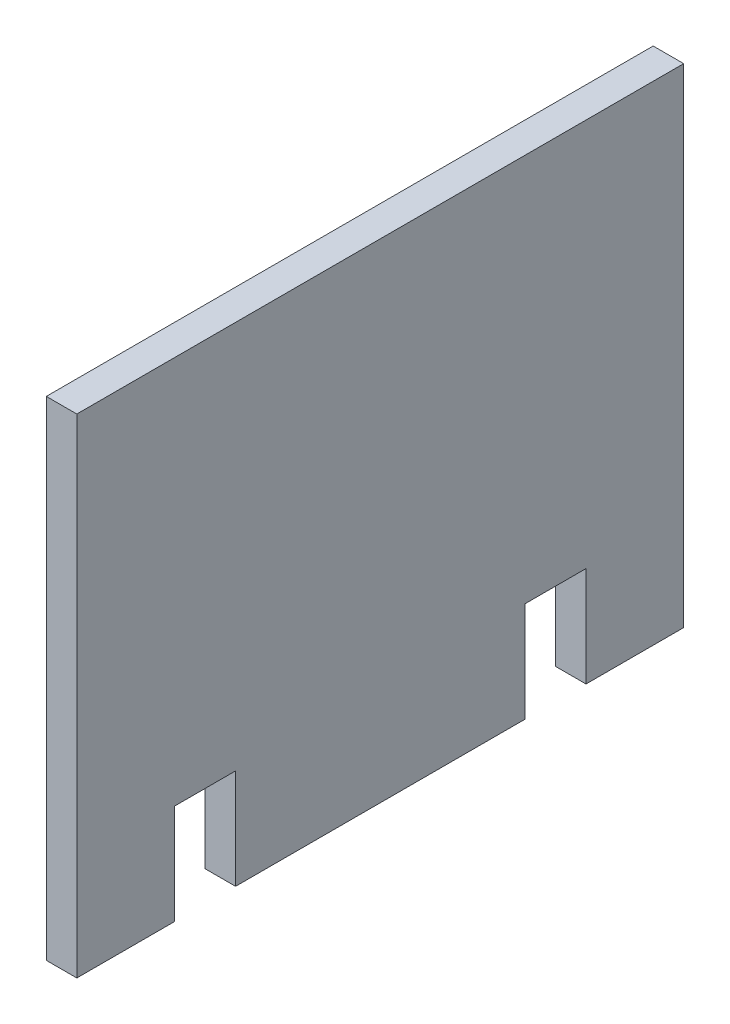
ISO-10303-21;
HEADER;
FILE_DESCRIPTION(('STEP AP214'),'2;1');
FILE_NAME('part.step','',(''),(''),'','','');
FILE_SCHEMA(('AUTOMOTIVE_DESIGN { 1 0 10303 214 1 1 1 1 }'));
ENDSEC;
DATA;
#1=APPLICATION_CONTEXT('core data for automotive mechanical design processes');
#2=APPLICATION_PROTOCOL_DEFINITION('international standard','automotive_design',2000,#1);
#3=PRODUCT_CONTEXT('',#1,'mechanical');
#4=PRODUCT('Part','Part','',(#3));
#5=PRODUCT_RELATED_PRODUCT_CATEGORY('part','',(#4));
#6=PRODUCT_DEFINITION_FORMATION('','',#4);
#7=PRODUCT_DEFINITION_CONTEXT('part definition',#1,'design');
#8=PRODUCT_DEFINITION('design','',#6,#7);
#9=PRODUCT_DEFINITION_SHAPE('','',#8);
#10=(LENGTH_UNIT() NAMED_UNIT(*) SI_UNIT(.MILLI.,.METRE.));
#11=(NAMED_UNIT(*) PLANE_ANGLE_UNIT() SI_UNIT($,.RADIAN.));
#12=(NAMED_UNIT(*) SI_UNIT($,.STERADIAN.) SOLID_ANGLE_UNIT());
#13=UNCERTAINTY_MEASURE_WITH_UNIT(LENGTH_MEASURE(1.E-05),#10,'distance_accuracy_value','');
#14=(GEOMETRIC_REPRESENTATION_CONTEXT(3) GLOBAL_UNCERTAINTY_ASSIGNED_CONTEXT((#13)) GLOBAL_UNIT_ASSIGNED_CONTEXT((#10,
#11,#12)) REPRESENTATION_CONTEXT('',''));
#15=CARTESIAN_POINT('',(0.,0.,0.));
#16=DIRECTION('',(0.,0.,1.));
#17=DIRECTION('',(1.,0.,0.));
#18=AXIS2_PLACEMENT_3D('',#15,#16,#17);
#19=CARTESIAN_POINT('',(3.175,0.,0.));
#20=DIRECTION('',(0.,1.,0.));
#21=DIRECTION('',(0.,0.,1.));
#22=AXIS2_PLACEMENT_3D('',#19,#20,#21);
#23=PLANE('',#22);
#24=DIRECTION('',(0.,0.,-1.));
#25=VECTOR('',#24,1.);
#26=CARTESIAN_POINT('',(0.,0.,0.));
#27=LINE('',#26,#25);
#28=CARTESIAN_POINT('',(0.,0.,0.));
#29=VERTEX_POINT('',#28);
#30=CARTESIAN_POINT('',(0.,0.,-10.16));
#31=VERTEX_POINT('',#30);
#32=EDGE_CURVE('E144',#29,#31,#27,.T.);
#33=ORIENTED_EDGE('',*,*,#32,.T.);
#34=DIRECTION('',(1.,0.,0.));
#35=VECTOR('',#34,1.);
#36=CARTESIAN_POINT('',(0.,0.,-10.16));
#37=LINE('',#36,#35);
#38=CARTESIAN_POINT('',(3.175,0.,-10.16));
#39=VERTEX_POINT('',#38);
#40=EDGE_CURVE('E130',#31,#39,#37,.T.);
#41=ORIENTED_EDGE('',*,*,#40,.T.);
#42=DIRECTION('',(0.,0.,-1.));
#43=VECTOR('',#42,1.);
#44=CARTESIAN_POINT('',(3.175,0.,0.));
#45=LINE('',#44,#43);
#46=CARTESIAN_POINT('',(3.175,0.,0.));
#47=VERTEX_POINT('',#46);
#48=EDGE_CURVE('E176',#47,#39,#45,.T.);
#49=ORIENTED_EDGE('',*,*,#48,.F.);
#50=DIRECTION('',(-1.,0.,0.));
#51=VECTOR('',#50,1.);
#52=CARTESIAN_POINT('',(3.175,0.,0.));
#53=LINE('',#52,#51);
#54=EDGE_CURVE('E11',#47,#29,#53,.T.);
#55=ORIENTED_EDGE('',*,*,#54,.T.);
#56=EDGE_LOOP('',(#33,#41,#49,#55));
#57=FACE_BOUND('',#56,.T.);
#58=ADVANCED_FACE('F41',(#57),#23,.F.);
#59=CARTESIAN_POINT('',(3.175,0.,-52.96));
#60=VERTEX_POINT('',#59);
#61=CARTESIAN_POINT('',(3.175,0.,-63.12));
#62=VERTEX_POINT('',#61);
#63=EDGE_CURVE('E179',#60,#62,#45,.T.);
#64=ORIENTED_EDGE('',*,*,#63,.F.);
#65=DIRECTION('',(1.,0.,0.));
#66=VECTOR('',#65,1.);
#67=CARTESIAN_POINT('',(0.,0.,-52.96));
#68=LINE('',#67,#66);
#69=CARTESIAN_POINT('',(0.,0.,-52.96));
#70=VERTEX_POINT('',#69);
#71=EDGE_CURVE('E199',#70,#60,#68,.T.);
#72=ORIENTED_EDGE('',*,*,#71,.F.);
#73=CARTESIAN_POINT('',(0.,0.,-63.12));
#74=VERTEX_POINT('',#73);
#75=EDGE_CURVE('E154',#70,#74,#27,.T.);
#76=ORIENTED_EDGE('',*,*,#75,.T.);
#77=DIRECTION('',(-1.,0.,0.));
#78=VECTOR('',#77,1.);
#79=CARTESIAN_POINT('',(3.175,0.,-63.12));
#80=LINE('',#79,#78);
#81=EDGE_CURVE('E49',#62,#74,#80,.T.);
#82=ORIENTED_EDGE('',*,*,#81,.F.);
#83=EDGE_LOOP('',(#64,#72,#76,#82));
#84=FACE_BOUND('',#83,.T.);
#85=ADVANCED_FACE('F233',(#84),#23,.F.);
#86=CARTESIAN_POINT('',(3.175,0.,0.));
#87=DIRECTION('',(0.,0.,-1.));
#88=DIRECTION('',(-1.,0.,0.));
#89=AXIS2_PLACEMENT_3D('',#86,#87,#88);
#90=PLANE('',#89);
#91=DIRECTION('',(0.,-1.,0.));
#92=VECTOR('',#91,1.);
#93=CARTESIAN_POINT('',(0.,0.,0.));
#94=LINE('',#93,#92);
#95=CARTESIAN_POINT('',(0.,50.8,0.));
#96=VERTEX_POINT('',#95);
#97=EDGE_CURVE('E159',#96,#29,#94,.T.);
#98=ORIENTED_EDGE('',*,*,#97,.T.);
#99=ORIENTED_EDGE('',*,*,#54,.F.);
#100=DIRECTION('',(0.,-1.,0.));
#101=VECTOR('',#100,1.);
#102=CARTESIAN_POINT('',(3.175,0.,0.));
#103=LINE('',#102,#101);
#104=CARTESIAN_POINT('',(3.175,50.8,0.));
#105=VERTEX_POINT('',#104);
#106=EDGE_CURVE('E180',#105,#47,#103,.T.);
#107=ORIENTED_EDGE('',*,*,#106,.F.);
#108=DIRECTION('',(-1.,0.,0.));
#109=VECTOR('',#108,1.);
#110=CARTESIAN_POINT('',(3.175,50.8,0.));
#111=LINE('',#110,#109);
#112=EDGE_CURVE('E173',#105,#96,#111,.T.);
#113=ORIENTED_EDGE('',*,*,#112,.T.);
#114=EDGE_LOOP('',(#98,#99,#107,#113));
#115=FACE_BOUND('',#114,.T.);
#116=ADVANCED_FACE('F43',(#115),#90,.F.);
#117=CARTESIAN_POINT('',(3.175,0.,-16.51));
#118=VERTEX_POINT('',#117);
#119=CARTESIAN_POINT('',(3.175,0.,-46.61));
#120=VERTEX_POINT('',#119);
#121=EDGE_CURVE('E178',#118,#120,#45,.T.);
#122=ORIENTED_EDGE('',*,*,#121,.F.);
#123=DIRECTION('',(1.,0.,0.));
#124=VECTOR('',#123,1.);
#125=CARTESIAN_POINT('',(0.,0.,-16.51));
#126=LINE('',#125,#124);
#127=CARTESIAN_POINT('',(0.,0.,-16.51));
#128=VERTEX_POINT('',#127);
#129=EDGE_CURVE('E139',#128,#118,#126,.T.);
#130=ORIENTED_EDGE('',*,*,#129,.F.);
#131=CARTESIAN_POINT('',(0.,0.,-46.61));
#132=VERTEX_POINT('',#131);
#133=EDGE_CURVE('E152',#128,#132,#27,.T.);
#134=ORIENTED_EDGE('',*,*,#133,.T.);
#135=DIRECTION('',(1.,0.,0.));
#136=VECTOR('',#135,1.);
#137=CARTESIAN_POINT('',(0.,0.,-46.61));
#138=LINE('',#137,#136);
#139=EDGE_CURVE('E201',#132,#120,#138,.T.);
#140=ORIENTED_EDGE('',*,*,#139,.T.);
#141=EDGE_LOOP('',(#122,#130,#134,#140));
#142=FACE_BOUND('',#141,.T.);
#143=ADVANCED_FACE('F223',(#142),#23,.F.);
#144=CARTESIAN_POINT('',(3.175,0.,-63.12));
#145=DIRECTION('',(0.,0.,1.));
#146=DIRECTION('',(1.,0.,0.));
#147=AXIS2_PLACEMENT_3D('',#144,#145,#146);
#148=PLANE('',#147);
#149=DIRECTION('',(0.,1.,0.));
#150=VECTOR('',#149,1.);
#151=CARTESIAN_POINT('',(0.,0.,-63.12));
#152=LINE('',#151,#150);
#153=CARTESIAN_POINT('',(0.,50.8,-63.12));
#154=VERTEX_POINT('',#153);
#155=EDGE_CURVE('E151',#74,#154,#152,.T.);
#156=ORIENTED_EDGE('',*,*,#155,.T.);
#157=DIRECTION('',(-1.,0.,0.));
#158=VECTOR('',#157,1.);
#159=CARTESIAN_POINT('',(3.175,50.8,-63.12));
#160=LINE('',#159,#158);
#161=CARTESIAN_POINT('',(3.175,50.8,-63.12));
#162=VERTEX_POINT('',#161);
#163=EDGE_CURVE('E236',#162,#154,#160,.T.);
#164=ORIENTED_EDGE('',*,*,#163,.F.);
#165=DIRECTION('',(0.,1.,0.));
#166=VECTOR('',#165,1.);
#167=CARTESIAN_POINT('',(3.175,0.,-63.12));
#168=LINE('',#167,#166);
#169=EDGE_CURVE('E174',#62,#162,#168,.T.);
#170=ORIENTED_EDGE('',*,*,#169,.F.);
#171=ORIENTED_EDGE('',*,*,#81,.T.);
#172=EDGE_LOOP('',(#156,#164,#170,#171));
#173=FACE_BOUND('',#172,.T.);
#174=ADVANCED_FACE('F237',(#173),#148,.F.);
#175=CARTESIAN_POINT('',(3.175,50.8,0.));
#176=DIRECTION('',(0.,-1.,0.));
#177=DIRECTION('',(0.,0.,-1.));
#178=AXIS2_PLACEMENT_3D('',#175,#176,#177);
#179=PLANE('',#178);
#180=DIRECTION('',(0.,0.,1.));
#181=VECTOR('',#180,1.);
#182=CARTESIAN_POINT('',(0.,50.8,0.));
#183=LINE('',#182,#181);
#184=EDGE_CURVE('E155',#154,#96,#183,.T.);
#185=ORIENTED_EDGE('',*,*,#184,.T.);
#186=ORIENTED_EDGE('',*,*,#112,.F.);
#187=DIRECTION('',(0.,0.,1.));
#188=VECTOR('',#187,1.);
#189=CARTESIAN_POINT('',(3.175,50.8,0.));
#190=LINE('',#189,#188);
#191=EDGE_CURVE('E171',#162,#105,#190,.T.);
#192=ORIENTED_EDGE('',*,*,#191,.F.);
#193=ORIENTED_EDGE('',*,*,#163,.T.);
#194=EDGE_LOOP('',(#185,#186,#192,#193));
#195=FACE_BOUND('',#194,.T.);
#196=ADVANCED_FACE('F244',(#195),#179,.F.);
#197=CARTESIAN_POINT('',(3.175,0.,0.));
#198=DIRECTION('',(-1.,0.,0.));
#199=DIRECTION('',(0.,0.,1.));
#200=AXIS2_PLACEMENT_3D('',#197,#198,#199);
#201=PLANE('',#200);
#202=ORIENTED_EDGE('',*,*,#48,.T.);
#203=DIRECTION('',(0.,-1.,0.));
#204=VECTOR('',#203,1.);
#205=CARTESIAN_POINT('',(3.175,0.,-10.16));
#206=LINE('',#205,#204);
#207=CARTESIAN_POINT('',(3.175,10.4,-10.16));
#208=VERTEX_POINT('',#207);
#209=EDGE_CURVE('E135',#208,#39,#206,.T.);
#210=ORIENTED_EDGE('',*,*,#209,.F.);
#211=DIRECTION('',(0.,0.,1.));
#212=VECTOR('',#211,1.);
#213=CARTESIAN_POINT('',(3.175,10.4,-10.16));
#214=LINE('',#213,#212);
#215=CARTESIAN_POINT('',(3.175,10.4,-16.51));
#216=VERTEX_POINT('',#215);
#217=EDGE_CURVE('E147',#216,#208,#214,.T.);
#218=ORIENTED_EDGE('',*,*,#217,.F.);
#219=DIRECTION('',(0.,1.,0.));
#220=VECTOR('',#219,1.);
#221=CARTESIAN_POINT('',(3.175,0.,-16.51));
#222=LINE('',#221,#220);
#223=EDGE_CURVE('E211',#118,#216,#222,.T.);
#224=ORIENTED_EDGE('',*,*,#223,.F.);
#225=ORIENTED_EDGE('',*,*,#121,.T.);
#226=DIRECTION('',(0.,-1.,0.));
#227=VECTOR('',#226,1.);
#228=CARTESIAN_POINT('',(3.175,0.,-46.61));
#229=LINE('',#228,#227);
#230=CARTESIAN_POINT('',(3.175,10.4,-46.61));
#231=VERTEX_POINT('',#230);
#232=EDGE_CURVE('E186',#231,#120,#229,.T.);
#233=ORIENTED_EDGE('',*,*,#232,.F.);
#234=DIRECTION('',(0.,0.,1.));
#235=VECTOR('',#234,1.);
#236=CARTESIAN_POINT('',(3.175,10.4,-52.96));
#237=LINE('',#236,#235);
#238=CARTESIAN_POINT('',(3.175,10.4,-52.96));
#239=VERTEX_POINT('',#238);
#240=EDGE_CURVE('E195',#239,#231,#237,.T.);
#241=ORIENTED_EDGE('',*,*,#240,.F.);
#242=DIRECTION('',(0.,1.,0.));
#243=VECTOR('',#242,1.);
#244=CARTESIAN_POINT('',(3.175,0.,-52.96));
#245=LINE('',#244,#243);
#246=EDGE_CURVE('E192',#60,#239,#245,.T.);
#247=ORIENTED_EDGE('',*,*,#246,.F.);
#248=ORIENTED_EDGE('',*,*,#63,.T.);
#249=ORIENTED_EDGE('',*,*,#169,.T.);
#250=ORIENTED_EDGE('',*,*,#191,.T.);
#251=ORIENTED_EDGE('',*,*,#106,.T.);
#252=EDGE_LOOP('',(#202,#210,#218,#224,#225,#233,#241,#247,#248,#249,#250,#251));
#253=FACE_BOUND('',#252,.T.);
#254=ADVANCED_FACE('F229',(#253),#201,.F.);
#255=CARTESIAN_POINT('',(0.,0.,0.));
#256=DIRECTION('',(-1.,0.,0.));
#257=DIRECTION('',(0.,0.,1.));
#258=AXIS2_PLACEMENT_3D('',#255,#256,#257);
#259=PLANE('',#258);
#260=DIRECTION('',(0.,-1.,0.));
#261=VECTOR('',#260,1.);
#262=CARTESIAN_POINT('',(0.,0.,-10.16));
#263=LINE('',#262,#261);
#264=CARTESIAN_POINT('',(0.,10.4,-10.16));
#265=VERTEX_POINT('',#264);
#266=EDGE_CURVE('E133',#265,#31,#263,.T.);
#267=ORIENTED_EDGE('',*,*,#266,.T.);
#268=ORIENTED_EDGE('',*,*,#32,.F.);
#269=ORIENTED_EDGE('',*,*,#97,.F.);
#270=ORIENTED_EDGE('',*,*,#184,.F.);
#271=ORIENTED_EDGE('',*,*,#155,.F.);
#272=ORIENTED_EDGE('',*,*,#75,.F.);
#273=DIRECTION('',(0.,1.,0.));
#274=VECTOR('',#273,1.);
#275=CARTESIAN_POINT('',(0.,0.,-52.96));
#276=LINE('',#275,#274);
#277=CARTESIAN_POINT('',(0.,10.4,-52.96));
#278=VERTEX_POINT('',#277);
#279=EDGE_CURVE('E183',#70,#278,#276,.T.);
#280=ORIENTED_EDGE('',*,*,#279,.T.);
#281=DIRECTION('',(0.,0.,1.));
#282=VECTOR('',#281,1.);
#283=CARTESIAN_POINT('',(0.,10.4,-52.96));
#284=LINE('',#283,#282);
#285=CARTESIAN_POINT('',(0.,10.4,-46.61));
#286=VERTEX_POINT('',#285);
#287=EDGE_CURVE('E187',#278,#286,#284,.T.);
#288=ORIENTED_EDGE('',*,*,#287,.T.);
#289=DIRECTION('',(0.,-1.,0.));
#290=VECTOR('',#289,1.);
#291=CARTESIAN_POINT('',(0.,0.,-46.61));
#292=LINE('',#291,#290);
#293=EDGE_CURVE('E64',#286,#132,#292,.T.);
#294=ORIENTED_EDGE('',*,*,#293,.T.);
#295=ORIENTED_EDGE('',*,*,#133,.F.);
#296=DIRECTION('',(0.,1.,0.));
#297=VECTOR('',#296,1.);
#298=CARTESIAN_POINT('',(0.,0.,-16.51));
#299=LINE('',#298,#297);
#300=CARTESIAN_POINT('',(0.,10.4,-16.51));
#301=VERTEX_POINT('',#300);
#302=EDGE_CURVE('E146',#128,#301,#299,.T.);
#303=ORIENTED_EDGE('',*,*,#302,.T.);
#304=DIRECTION('',(0.,0.,1.));
#305=VECTOR('',#304,1.);
#306=CARTESIAN_POINT('',(0.,10.4,-10.16));
#307=LINE('',#306,#305);
#308=EDGE_CURVE('E56',#301,#265,#307,.T.);
#309=ORIENTED_EDGE('',*,*,#308,.T.);
#310=EDGE_LOOP('',(#267,#268,#269,#270,#271,#272,#280,#288,#294,#295,#303,#309));
#311=FACE_BOUND('',#310,.T.);
#312=ADVANCED_FACE('F142',(#311),#259,.T.);
#313=CARTESIAN_POINT('',(0.,0.,-52.96));
#314=DIRECTION('',(0.,0.,-1.));
#315=DIRECTION('',(0.,1.,0.));
#316=AXIS2_PLACEMENT_3D('',#313,#314,#315);
#317=PLANE('',#316);
#318=ORIENTED_EDGE('',*,*,#246,.T.);
#319=DIRECTION('',(1.,0.,0.));
#320=VECTOR('',#319,1.);
#321=CARTESIAN_POINT('',(0.,10.4,-52.96));
#322=LINE('',#321,#320);
#323=EDGE_CURVE('E191',#278,#239,#322,.T.);
#324=ORIENTED_EDGE('',*,*,#323,.F.);
#325=ORIENTED_EDGE('',*,*,#279,.F.);
#326=ORIENTED_EDGE('',*,*,#71,.T.);
#327=EDGE_LOOP('',(#318,#324,#325,#326));
#328=FACE_BOUND('',#327,.T.);
#329=ADVANCED_FACE('F261',(#328),#317,.F.);
#330=CARTESIAN_POINT('',(0.,0.,-46.61));
#331=DIRECTION('',(0.,0.,1.));
#332=DIRECTION('',(0.,-1.,0.));
#333=AXIS2_PLACEMENT_3D('',#330,#331,#332);
#334=PLANE('',#333);
#335=ORIENTED_EDGE('',*,*,#232,.T.);
#336=ORIENTED_EDGE('',*,*,#139,.F.);
#337=ORIENTED_EDGE('',*,*,#293,.F.);
#338=DIRECTION('',(1.,0.,0.));
#339=VECTOR('',#338,1.);
#340=CARTESIAN_POINT('',(0.,10.4,-46.61));
#341=LINE('',#340,#339);
#342=EDGE_CURVE('E204',#286,#231,#341,.T.);
#343=ORIENTED_EDGE('',*,*,#342,.T.);
#344=EDGE_LOOP('',(#335,#336,#337,#343));
#345=FACE_BOUND('',#344,.T.);
#346=ADVANCED_FACE('F264',(#345),#334,.F.);
#347=CARTESIAN_POINT('',(0.,10.4,-52.96));
#348=DIRECTION('',(0.,1.,0.));
#349=DIRECTION('',(0.,0.,1.));
#350=AXIS2_PLACEMENT_3D('',#347,#348,#349);
#351=PLANE('',#350);
#352=ORIENTED_EDGE('',*,*,#240,.T.);
#353=ORIENTED_EDGE('',*,*,#342,.F.);
#354=ORIENTED_EDGE('',*,*,#287,.F.);
#355=ORIENTED_EDGE('',*,*,#323,.T.);
#356=EDGE_LOOP('',(#352,#353,#354,#355));
#357=FACE_BOUND('',#356,.T.);
#358=ADVANCED_FACE('F267',(#357),#351,.F.);
#359=CARTESIAN_POINT('',(0.,0.,-10.16));
#360=DIRECTION('',(0.,0.,1.));
#361=DIRECTION('',(1.,0.,0.));
#362=AXIS2_PLACEMENT_3D('',#359,#360,#361);
#363=PLANE('',#362);
#364=ORIENTED_EDGE('',*,*,#209,.T.);
#365=ORIENTED_EDGE('',*,*,#40,.F.);
#366=ORIENTED_EDGE('',*,*,#266,.F.);
#367=DIRECTION('',(1.,0.,0.));
#368=VECTOR('',#367,1.);
#369=CARTESIAN_POINT('',(0.,10.4,-10.16));
#370=LINE('',#369,#368);
#371=EDGE_CURVE('E165',#265,#208,#370,.T.);
#372=ORIENTED_EDGE('',*,*,#371,.T.);
#373=EDGE_LOOP('',(#364,#365,#366,#372));
#374=FACE_BOUND('',#373,.T.);
#375=ADVANCED_FACE('F132',(#374),#363,.F.);
#376=CARTESIAN_POINT('',(0.,10.4,-10.16));
#377=DIRECTION('',(0.,1.,0.));
#378=DIRECTION('',(0.,0.,1.));
#379=AXIS2_PLACEMENT_3D('',#376,#377,#378);
#380=PLANE('',#379);
#381=ORIENTED_EDGE('',*,*,#217,.T.);
#382=ORIENTED_EDGE('',*,*,#371,.F.);
#383=ORIENTED_EDGE('',*,*,#308,.F.);
#384=DIRECTION('',(1.,0.,0.));
#385=VECTOR('',#384,1.);
#386=CARTESIAN_POINT('',(0.,10.4,-16.51));
#387=LINE('',#386,#385);
#388=EDGE_CURVE('E168',#301,#216,#387,.T.);
#389=ORIENTED_EDGE('',*,*,#388,.T.);
#390=EDGE_LOOP('',(#381,#382,#383,#389));
#391=FACE_BOUND('',#390,.T.);
#392=ADVANCED_FACE('F276',(#391),#380,.F.);
#393=CARTESIAN_POINT('',(0.,0.,-16.51));
#394=DIRECTION('',(0.,0.,-1.));
#395=DIRECTION('',(-1.,0.,0.));
#396=AXIS2_PLACEMENT_3D('',#393,#394,#395);
#397=PLANE('',#396);
#398=ORIENTED_EDGE('',*,*,#223,.T.);
#399=ORIENTED_EDGE('',*,*,#388,.F.);
#400=ORIENTED_EDGE('',*,*,#302,.F.);
#401=ORIENTED_EDGE('',*,*,#129,.T.);
#402=EDGE_LOOP('',(#398,#399,#400,#401));
#403=FACE_BOUND('',#402,.T.);
#404=ADVANCED_FACE('F219',(#403),#397,.F.);
#405=CLOSED_SHELL('',(#58,#85,#116,#143,#174,#196,#254,#312,#329,#346,#358,#375,#392,#404));
#406=MANIFOLD_SOLID_BREP('B2',#405);
#407=ADVANCED_BREP_SHAPE_REPRESENTATION('',(#18,#406),#14);
#408=SHAPE_DEFINITION_REPRESENTATION(#9,#407);
ENDSEC;
END-ISO-10303-21;
